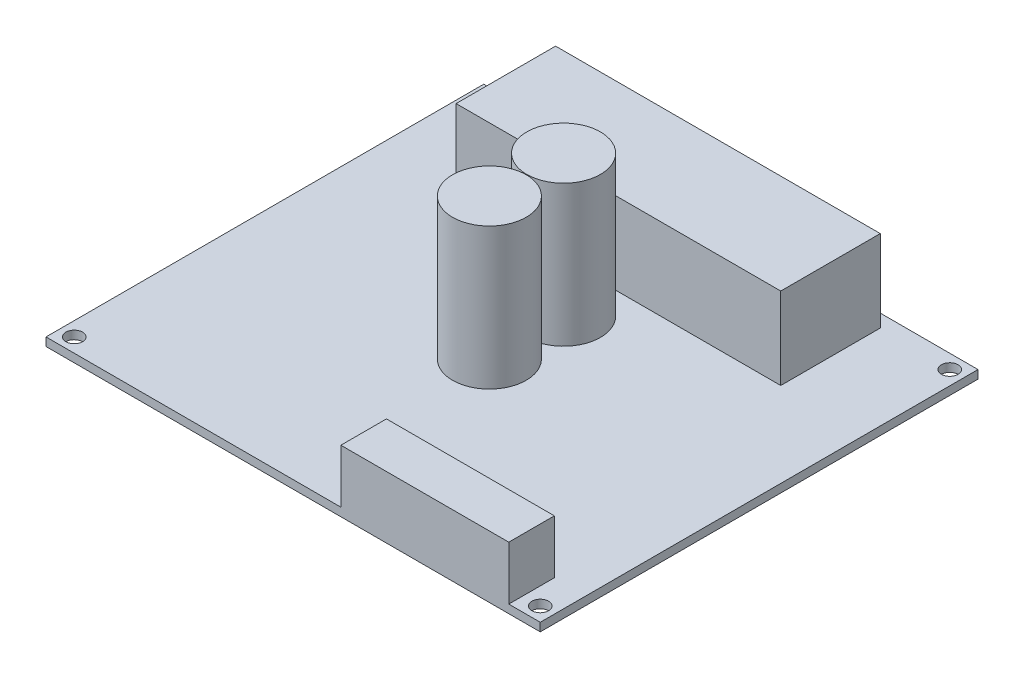
ISO-10303-21;
HEADER;
FILE_DESCRIPTION(('STEP AP214'),'2;1');
FILE_NAME('part.step','',(''),(''),'','','');
FILE_SCHEMA(('AUTOMOTIVE_DESIGN { 1 0 10303 214 1 1 1 1 }'));
ENDSEC;
DATA;
#1=APPLICATION_CONTEXT('core data for automotive mechanical design processes');
#2=APPLICATION_PROTOCOL_DEFINITION('international standard','automotive_design',2000,#1);
#3=PRODUCT_CONTEXT('',#1,'mechanical');
#4=PRODUCT('Part','Part','',(#3));
#5=PRODUCT_RELATED_PRODUCT_CATEGORY('part','',(#4));
#6=PRODUCT_DEFINITION_FORMATION('','',#4);
#7=PRODUCT_DEFINITION_CONTEXT('part definition',#1,'design');
#8=PRODUCT_DEFINITION('design','',#6,#7);
#9=PRODUCT_DEFINITION_SHAPE('','',#8);
#10=(LENGTH_UNIT() NAMED_UNIT(*) SI_UNIT(.MILLI.,.METRE.));
#11=(NAMED_UNIT(*) PLANE_ANGLE_UNIT() SI_UNIT($,.RADIAN.));
#12=(NAMED_UNIT(*) SI_UNIT($,.STERADIAN.) SOLID_ANGLE_UNIT());
#13=UNCERTAINTY_MEASURE_WITH_UNIT(LENGTH_MEASURE(1.E-05),#10,'distance_accuracy_value','');
#14=(GEOMETRIC_REPRESENTATION_CONTEXT(3) GLOBAL_UNCERTAINTY_ASSIGNED_CONTEXT((#13)) GLOBAL_UNIT_ASSIGNED_CONTEXT((#10,
#11,#12)) REPRESENTATION_CONTEXT('',''));
#15=CARTESIAN_POINT('',(0.,0.,0.));
#16=DIRECTION('',(0.,0.,1.));
#17=DIRECTION('',(1.,0.,0.));
#18=AXIS2_PLACEMENT_3D('',#15,#16,#17);
#19=CARTESIAN_POINT('',(0.,1.5,0.));
#20=DIRECTION('',(0.,1.,0.));
#21=DIRECTION('',(0.,0.,1.));
#22=AXIS2_PLACEMENT_3D('',#19,#20,#21);
#23=PLANE('',#22);
#24=CARTESIAN_POINT('',(-1.125,1.5,2.945));
#25=DIRECTION('',(0.,1.,0.));
#26=DIRECTION('',(0.,0.,1.));
#27=AXIS2_PLACEMENT_3D('',#24,#25,#26);
#28=CIRCLE('',#27,6.625);
#29=CARTESIAN_POINT('',(-1.125,1.5,9.57));
#30=VERTEX_POINT('',#29);
#31=EDGE_CURVE('E316',#30,#30,#28,.T.);
#32=ORIENTED_EDGE('',*,*,#31,.F.);
#33=EDGE_LOOP('',(#32));
#34=FACE_BOUND('',#33,.T.);
#35=CARTESIAN_POINT('',(-1.125,1.5,-10.405));
#36=DIRECTION('',(0.,1.,0.));
#37=DIRECTION('',(0.,0.,1.));
#38=AXIS2_PLACEMENT_3D('',#35,#36,#37);
#39=CIRCLE('',#38,6.62500000000001);
#40=CARTESIAN_POINT('',(-1.125,1.5,-3.78));
#41=VERTEX_POINT('',#40);
#42=EDGE_CURVE('E312',#41,#41,#39,.T.);
#43=ORIENTED_EDGE('',*,*,#42,.F.);
#44=EDGE_LOOP('',(#43));
#45=FACE_BOUND('',#44,.T.);
#46=CARTESIAN_POINT('',(41.91,1.5,-36.83));
#47=DIRECTION('',(0.,1.,0.));
#48=DIRECTION('',(0.,0.,1.));
#49=AXIS2_PLACEMENT_3D('',#46,#47,#48);
#50=CIRCLE('',#49,1.5);
#51=CARTESIAN_POINT('',(41.91,1.5,-35.33));
#52=VERTEX_POINT('',#51);
#53=EDGE_CURVE('E215',#52,#52,#50,.T.);
#54=ORIENTED_EDGE('',*,*,#53,.F.);
#55=EDGE_LOOP('',(#54));
#56=FACE_BOUND('',#55,.T.);
#57=CARTESIAN_POINT('',(-41.91,1.5,-36.83));
#58=DIRECTION('',(0.,1.,0.));
#59=DIRECTION('',(0.,0.,1.));
#60=AXIS2_PLACEMENT_3D('',#57,#58,#59);
#61=CIRCLE('',#60,1.5);
#62=CARTESIAN_POINT('',(-41.91,1.5,-35.33));
#63=VERTEX_POINT('',#62);
#64=EDGE_CURVE('E231',#63,#63,#61,.T.);
#65=ORIENTED_EDGE('',*,*,#64,.F.);
#66=EDGE_LOOP('',(#65));
#67=FACE_BOUND('',#66,.T.);
#68=CARTESIAN_POINT('',(41.91,1.5,36.83));
#69=DIRECTION('',(0.,1.,0.));
#70=DIRECTION('',(0.,0.,1.));
#71=AXIS2_PLACEMENT_3D('',#68,#69,#70);
#72=CIRCLE('',#71,1.5);
#73=CARTESIAN_POINT('',(41.91,1.5,38.33));
#74=VERTEX_POINT('',#73);
#75=EDGE_CURVE('E223',#74,#74,#72,.T.);
#76=ORIENTED_EDGE('',*,*,#75,.F.);
#77=EDGE_LOOP('',(#76));
#78=FACE_BOUND('',#77,.T.);
#79=CARTESIAN_POINT('',(-41.91,1.5,36.83));
#80=DIRECTION('',(0.,1.,0.));
#81=DIRECTION('',(0.,0.,1.));
#82=AXIS2_PLACEMENT_3D('',#79,#80,#81);
#83=CIRCLE('',#82,1.5);
#84=CARTESIAN_POINT('',(-41.91,1.5,38.33));
#85=VERTEX_POINT('',#84);
#86=EDGE_CURVE('E207',#85,#85,#83,.T.);
#87=ORIENTED_EDGE('',*,*,#86,.F.);
#88=EDGE_LOOP('',(#87));
#89=FACE_BOUND('',#88,.T.);
#90=DIRECTION('',(-1.,0.,0.));
#91=VECTOR('',#90,1.);
#92=CARTESIAN_POINT('',(-29.2,1.5,-37.04));
#93=LINE('',#92,#91);
#94=CARTESIAN_POINT('',(29.2,1.5,-37.04));
#95=VERTEX_POINT('',#94);
#96=CARTESIAN_POINT('',(-29.2,1.5,-37.04));
#97=VERTEX_POINT('',#96);
#98=EDGE_CURVE('E164',#95,#97,#93,.T.);
#99=ORIENTED_EDGE('',*,*,#98,.F.);
#100=DIRECTION('',(0.,0.,-1.));
#101=VECTOR('',#100,1.);
#102=CARTESIAN_POINT('',(29.2,1.5,-19.14));
#103=LINE('',#102,#101);
#104=CARTESIAN_POINT('',(29.2,1.5,-19.14));
#105=VERTEX_POINT('',#104);
#106=EDGE_CURVE('E159',#105,#95,#103,.T.);
#107=ORIENTED_EDGE('',*,*,#106,.F.);
#108=DIRECTION('',(1.,0.,0.));
#109=VECTOR('',#108,1.);
#110=CARTESIAN_POINT('',(-29.2,1.5,-19.14));
#111=LINE('',#110,#109);
#112=CARTESIAN_POINT('',(-29.2,1.5,-19.14));
#113=VERTEX_POINT('',#112);
#114=EDGE_CURVE('E175',#113,#105,#111,.T.);
#115=ORIENTED_EDGE('',*,*,#114,.F.);
#116=DIRECTION('',(0.,0.,1.));
#117=VECTOR('',#116,1.);
#118=CARTESIAN_POINT('',(-29.2,1.5,-19.14));
#119=LINE('',#118,#117);
#120=EDGE_CURVE('E187',#97,#113,#119,.T.);
#121=ORIENTED_EDGE('',*,*,#120,.F.);
#122=EDGE_LOOP('',(#99,#107,#115,#121));
#123=FACE_BOUND('',#122,.T.);
#124=DIRECTION('',(-1.,0.,0.));
#125=VECTOR('',#124,1.);
#126=CARTESIAN_POINT('',(8.59000000000001,1.5,31.17));
#127=LINE('',#126,#125);
#128=CARTESIAN_POINT('',(38.79,1.5,31.17));
#129=VERTEX_POINT('',#128);
#130=CARTESIAN_POINT('',(8.59000000000001,1.5,31.17));
#131=VERTEX_POINT('',#130);
#132=EDGE_CURVE('E61',#129,#131,#127,.T.);
#133=ORIENTED_EDGE('',*,*,#132,.F.);
#134=DIRECTION('',(0.,0.,-1.));
#135=VECTOR('',#134,1.);
#136=CARTESIAN_POINT('',(38.79,1.5,39.37));
#137=LINE('',#136,#135);
#138=CARTESIAN_POINT('',(38.79,1.5,39.37));
#139=VERTEX_POINT('',#138);
#140=EDGE_CURVE('E157',#139,#129,#137,.T.);
#141=ORIENTED_EDGE('',*,*,#140,.F.);
#142=DIRECTION('',(1.,0.,0.));
#143=VECTOR('',#142,1.);
#144=CARTESIAN_POINT('',(44.45,1.5,39.37));
#145=LINE('',#144,#143);
#146=CARTESIAN_POINT('',(44.45,1.5,39.37));
#147=VERTEX_POINT('',#146);
#148=EDGE_CURVE('E243',#139,#147,#145,.T.);
#149=ORIENTED_EDGE('',*,*,#148,.T.);
#150=DIRECTION('',(0.,0.,-1.));
#151=VECTOR('',#150,1.);
#152=CARTESIAN_POINT('',(44.45,1.5,39.37));
#153=LINE('',#152,#151);
#154=CARTESIAN_POINT('',(44.45,1.5,-39.37));
#155=VERTEX_POINT('',#154);
#156=EDGE_CURVE('E248',#147,#155,#153,.T.);
#157=ORIENTED_EDGE('',*,*,#156,.T.);
#158=DIRECTION('',(-1.,0.,0.));
#159=VECTOR('',#158,1.);
#160=CARTESIAN_POINT('',(44.45,1.5,-39.37));
#161=LINE('',#160,#159);
#162=CARTESIAN_POINT('',(-44.45,1.5,-39.37));
#163=VERTEX_POINT('',#162);
#164=EDGE_CURVE('E251',#155,#163,#161,.T.);
#165=ORIENTED_EDGE('',*,*,#164,.T.);
#166=DIRECTION('',(0.,0.,1.));
#167=VECTOR('',#166,1.);
#168=CARTESIAN_POINT('',(-44.45,1.5,39.37));
#169=LINE('',#168,#167);
#170=CARTESIAN_POINT('',(-44.45,1.5,39.37));
#171=VERTEX_POINT('',#170);
#172=EDGE_CURVE('E239',#163,#171,#169,.T.);
#173=ORIENTED_EDGE('',*,*,#172,.T.);
#174=CARTESIAN_POINT('',(8.59000000000001,1.5,39.37));
#175=VERTEX_POINT('',#174);
#176=EDGE_CURVE('E245',#171,#175,#145,.T.);
#177=ORIENTED_EDGE('',*,*,#176,.T.);
#178=DIRECTION('',(0.,0.,1.));
#179=VECTOR('',#178,1.);
#180=CARTESIAN_POINT('',(8.59000000000001,1.5,39.37));
#181=LINE('',#180,#179);
#182=EDGE_CURVE('E66',#131,#175,#181,.T.);
#183=ORIENTED_EDGE('',*,*,#182,.F.);
#184=EDGE_LOOP('',(#133,#141,#149,#157,#165,#173,#177,#183));
#185=FACE_BOUND('',#184,.T.);
#186=ADVANCED_FACE('F45',(#34,#45,#56,#67,#78,#89,#123,#185),#23,.T.);
#187=CARTESIAN_POINT('',(0.,0.,0.));
#188=DIRECTION('',(0.,1.,0.));
#189=DIRECTION('',(0.,0.,1.));
#190=AXIS2_PLACEMENT_3D('',#187,#188,#189);
#191=PLANE('',#190);
#192=DIRECTION('',(0.,0.,1.));
#193=VECTOR('',#192,1.);
#194=CARTESIAN_POINT('',(-44.45,0.,39.37));
#195=LINE('',#194,#193);
#196=CARTESIAN_POINT('',(-44.45,0.,-39.37));
#197=VERTEX_POINT('',#196);
#198=CARTESIAN_POINT('',(-44.45,0.,39.37));
#199=VERTEX_POINT('',#198);
#200=EDGE_CURVE('E235',#197,#199,#195,.T.);
#201=ORIENTED_EDGE('',*,*,#200,.F.);
#202=DIRECTION('',(-1.,0.,0.));
#203=VECTOR('',#202,1.);
#204=CARTESIAN_POINT('',(44.45,0.,-39.37));
#205=LINE('',#204,#203);
#206=CARTESIAN_POINT('',(44.45,0.,-39.37));
#207=VERTEX_POINT('',#206);
#208=EDGE_CURVE('E244',#207,#197,#205,.T.);
#209=ORIENTED_EDGE('',*,*,#208,.F.);
#210=DIRECTION('',(0.,0.,-1.));
#211=VECTOR('',#210,1.);
#212=CARTESIAN_POINT('',(44.45,0.,39.37));
#213=LINE('',#212,#211);
#214=CARTESIAN_POINT('',(44.45,0.,39.37));
#215=VERTEX_POINT('',#214);
#216=EDGE_CURVE('E261',#215,#207,#213,.T.);
#217=ORIENTED_EDGE('',*,*,#216,.F.);
#218=DIRECTION('',(1.,0.,0.));
#219=VECTOR('',#218,1.);
#220=CARTESIAN_POINT('',(44.45,0.,39.37));
#221=LINE('',#220,#219);
#222=EDGE_CURVE('E258',#199,#215,#221,.T.);
#223=ORIENTED_EDGE('',*,*,#222,.F.);
#224=EDGE_LOOP('',(#201,#209,#217,#223));
#225=FACE_BOUND('',#224,.T.);
#226=CARTESIAN_POINT('',(-41.91,0.,-36.83));
#227=DIRECTION('',(0.,1.,0.));
#228=DIRECTION('',(0.,0.,1.));
#229=AXIS2_PLACEMENT_3D('',#226,#227,#228);
#230=CIRCLE('',#229,1.5);
#231=CARTESIAN_POINT('',(-41.91,0.,-35.33));
#232=VERTEX_POINT('',#231);
#233=EDGE_CURVE('E227',#232,#232,#230,.T.);
#234=ORIENTED_EDGE('',*,*,#233,.T.);
#235=EDGE_LOOP('',(#234));
#236=FACE_BOUND('',#235,.T.);
#237=CARTESIAN_POINT('',(41.91,0.,36.83));
#238=DIRECTION('',(0.,1.,0.));
#239=DIRECTION('',(0.,0.,1.));
#240=AXIS2_PLACEMENT_3D('',#237,#238,#239);
#241=CIRCLE('',#240,1.5);
#242=CARTESIAN_POINT('',(41.91,0.,38.33));
#243=VERTEX_POINT('',#242);
#244=EDGE_CURVE('E219',#243,#243,#241,.T.);
#245=ORIENTED_EDGE('',*,*,#244,.T.);
#246=EDGE_LOOP('',(#245));
#247=FACE_BOUND('',#246,.T.);
#248=CARTESIAN_POINT('',(41.91,0.,-36.83));
#249=DIRECTION('',(0.,1.,0.));
#250=DIRECTION('',(0.,0.,1.));
#251=AXIS2_PLACEMENT_3D('',#248,#249,#250);
#252=CIRCLE('',#251,1.5);
#253=CARTESIAN_POINT('',(41.91,0.,-35.33));
#254=VERTEX_POINT('',#253);
#255=EDGE_CURVE('E211',#254,#254,#252,.T.);
#256=ORIENTED_EDGE('',*,*,#255,.T.);
#257=EDGE_LOOP('',(#256));
#258=FACE_BOUND('',#257,.T.);
#259=CARTESIAN_POINT('',(-41.91,0.,36.83));
#260=DIRECTION('',(0.,1.,0.));
#261=DIRECTION('',(0.,0.,1.));
#262=AXIS2_PLACEMENT_3D('',#259,#260,#261);
#263=CIRCLE('',#262,1.5);
#264=CARTESIAN_POINT('',(-41.91,0.,38.33));
#265=VERTEX_POINT('',#264);
#266=EDGE_CURVE('E206',#265,#265,#263,.T.);
#267=ORIENTED_EDGE('',*,*,#266,.T.);
#268=EDGE_LOOP('',(#267));
#269=FACE_BOUND('',#268,.T.);
#270=ADVANCED_FACE('F284',(#225,#236,#247,#258,#269),#191,.F.);
#271=CARTESIAN_POINT('',(-44.45,1.5,39.37));
#272=DIRECTION('',(1.,0.,0.));
#273=DIRECTION('',(0.,0.,-1.));
#274=AXIS2_PLACEMENT_3D('',#271,#272,#273);
#275=PLANE('',#274);
#276=ORIENTED_EDGE('',*,*,#200,.T.);
#277=DIRECTION('',(0.,-1.,0.));
#278=VECTOR('',#277,1.);
#279=CARTESIAN_POINT('',(-44.45,1.5,39.37));
#280=LINE('',#279,#278);
#281=EDGE_CURVE('E11',#171,#199,#280,.T.);
#282=ORIENTED_EDGE('',*,*,#281,.F.);
#283=ORIENTED_EDGE('',*,*,#172,.F.);
#284=DIRECTION('',(0.,-1.,0.));
#285=VECTOR('',#284,1.);
#286=CARTESIAN_POINT('',(-44.45,1.5,-39.37));
#287=LINE('',#286,#285);
#288=EDGE_CURVE('E254',#163,#197,#287,.T.);
#289=ORIENTED_EDGE('',*,*,#288,.T.);
#290=EDGE_LOOP('',(#276,#282,#283,#289));
#291=FACE_BOUND('',#290,.T.);
#292=ADVANCED_FACE('F47',(#291),#275,.F.);
#293=CARTESIAN_POINT('',(44.45,1.5,39.37));
#294=DIRECTION('',(0.,0.,-1.));
#295=DIRECTION('',(-1.,0.,0.));
#296=AXIS2_PLACEMENT_3D('',#293,#294,#295);
#297=PLANE('',#296);
#298=ORIENTED_EDGE('',*,*,#222,.T.);
#299=DIRECTION('',(0.,-1.,0.));
#300=VECTOR('',#299,1.);
#301=CARTESIAN_POINT('',(44.45,1.5,39.37));
#302=LINE('',#301,#300);
#303=EDGE_CURVE('E54',#147,#215,#302,.T.);
#304=ORIENTED_EDGE('',*,*,#303,.F.);
#305=ORIENTED_EDGE('',*,*,#148,.F.);
#306=DIRECTION('',(0.,-1.,0.));
#307=VECTOR('',#306,1.);
#308=CARTESIAN_POINT('',(38.79,11.15,39.37));
#309=LINE('',#308,#307);
#310=CARTESIAN_POINT('',(38.79,11.15,39.37));
#311=VERTEX_POINT('',#310);
#312=EDGE_CURVE('E295',#311,#139,#309,.T.);
#313=ORIENTED_EDGE('',*,*,#312,.F.);
#314=DIRECTION('',(1.,0.,0.));
#315=VECTOR('',#314,1.);
#316=CARTESIAN_POINT('',(8.59000000000001,11.15,39.37));
#317=LINE('',#316,#315);
#318=CARTESIAN_POINT('',(8.59000000000001,11.15,39.37));
#319=VERTEX_POINT('',#318);
#320=EDGE_CURVE('E150',#319,#311,#317,.T.);
#321=ORIENTED_EDGE('',*,*,#320,.F.);
#322=DIRECTION('',(0.,-1.,0.));
#323=VECTOR('',#322,1.);
#324=CARTESIAN_POINT('',(8.59000000000001,11.15,39.37));
#325=LINE('',#324,#323);
#326=EDGE_CURVE('E166',#319,#175,#325,.T.);
#327=ORIENTED_EDGE('',*,*,#326,.T.);
#328=ORIENTED_EDGE('',*,*,#176,.F.);
#329=ORIENTED_EDGE('',*,*,#281,.T.);
#330=EDGE_LOOP('',(#298,#304,#305,#313,#321,#327,#328,#329));
#331=FACE_BOUND('',#330,.T.);
#332=ADVANCED_FACE('F294',(#331),#297,.F.);
#333=CARTESIAN_POINT('',(44.45,1.5,39.37));
#334=DIRECTION('',(-1.,0.,0.));
#335=DIRECTION('',(0.,0.,1.));
#336=AXIS2_PLACEMENT_3D('',#333,#334,#335);
#337=PLANE('',#336);
#338=ORIENTED_EDGE('',*,*,#216,.T.);
#339=DIRECTION('',(0.,-1.,0.));
#340=VECTOR('',#339,1.);
#341=CARTESIAN_POINT('',(44.45,1.5,-39.37));
#342=LINE('',#341,#340);
#343=EDGE_CURVE('E269',#155,#207,#342,.T.);
#344=ORIENTED_EDGE('',*,*,#343,.F.);
#345=ORIENTED_EDGE('',*,*,#156,.F.);
#346=ORIENTED_EDGE('',*,*,#303,.T.);
#347=EDGE_LOOP('',(#338,#344,#345,#346));
#348=FACE_BOUND('',#347,.T.);
#349=ADVANCED_FACE('F278',(#348),#337,.F.);
#350=CARTESIAN_POINT('',(44.45,1.5,-39.37));
#351=DIRECTION('',(0.,0.,1.));
#352=DIRECTION('',(1.,0.,0.));
#353=AXIS2_PLACEMENT_3D('',#350,#351,#352);
#354=PLANE('',#353);
#355=ORIENTED_EDGE('',*,*,#208,.T.);
#356=ORIENTED_EDGE('',*,*,#288,.F.);
#357=ORIENTED_EDGE('',*,*,#164,.F.);
#358=ORIENTED_EDGE('',*,*,#343,.T.);
#359=EDGE_LOOP('',(#355,#356,#357,#358));
#360=FACE_BOUND('',#359,.T.);
#361=ADVANCED_FACE('F288',(#360),#354,.F.);
#362=CARTESIAN_POINT('',(-41.91,1.5,-36.83));
#363=DIRECTION('',(0.,-1.,0.));
#364=DIRECTION('',(0.,0.,-1.));
#365=AXIS2_PLACEMENT_3D('',#362,#363,#364);
#366=CYLINDRICAL_SURFACE('',#365,1.5);
#367=ORIENTED_EDGE('',*,*,#64,.T.);
#368=EDGE_LOOP('',(#367));
#369=FACE_BOUND('',#368,.T.);
#370=ORIENTED_EDGE('',*,*,#233,.F.);
#371=EDGE_LOOP('',(#370));
#372=FACE_BOUND('',#371,.T.);
#373=ADVANCED_FACE('F389',(#369,#372),#366,.F.);
#374=CARTESIAN_POINT('',(41.91,1.5,36.83));
#375=DIRECTION('',(0.,-1.,0.));
#376=DIRECTION('',(0.,0.,-1.));
#377=AXIS2_PLACEMENT_3D('',#374,#375,#376);
#378=CYLINDRICAL_SURFACE('',#377,1.5);
#379=ORIENTED_EDGE('',*,*,#75,.T.);
#380=EDGE_LOOP('',(#379));
#381=FACE_BOUND('',#380,.T.);
#382=ORIENTED_EDGE('',*,*,#244,.F.);
#383=EDGE_LOOP('',(#382));
#384=FACE_BOUND('',#383,.T.);
#385=ADVANCED_FACE('F385',(#381,#384),#378,.F.);
#386=CARTESIAN_POINT('',(41.91,1.5,-36.83));
#387=DIRECTION('',(0.,-1.,0.));
#388=DIRECTION('',(0.,0.,-1.));
#389=AXIS2_PLACEMENT_3D('',#386,#387,#388);
#390=CYLINDRICAL_SURFACE('',#389,1.5);
#391=ORIENTED_EDGE('',*,*,#53,.T.);
#392=EDGE_LOOP('',(#391));
#393=FACE_BOUND('',#392,.T.);
#394=ORIENTED_EDGE('',*,*,#255,.F.);
#395=EDGE_LOOP('',(#394));
#396=FACE_BOUND('',#395,.T.);
#397=ADVANCED_FACE('F381',(#393,#396),#390,.F.);
#398=CARTESIAN_POINT('',(-41.91,1.5,36.83));
#399=DIRECTION('',(0.,-1.,0.));
#400=DIRECTION('',(0.,0.,-1.));
#401=AXIS2_PLACEMENT_3D('',#398,#399,#400);
#402=CYLINDRICAL_SURFACE('',#401,1.5);
#403=ORIENTED_EDGE('',*,*,#86,.T.);
#404=EDGE_LOOP('',(#403));
#405=FACE_BOUND('',#404,.T.);
#406=ORIENTED_EDGE('',*,*,#266,.F.);
#407=EDGE_LOOP('',(#406));
#408=FACE_BOUND('',#407,.T.);
#409=ADVANCED_FACE('F378',(#405,#408),#402,.F.);
#410=CARTESIAN_POINT('',(29.2,16.22,-19.14));
#411=DIRECTION('',(-1.,0.,0.));
#412=DIRECTION('',(0.,0.,1.));
#413=AXIS2_PLACEMENT_3D('',#410,#411,#412);
#414=PLANE('',#413);
#415=ORIENTED_EDGE('',*,*,#106,.T.);
#416=DIRECTION('',(0.,-1.,0.));
#417=VECTOR('',#416,1.);
#418=CARTESIAN_POINT('',(29.2,16.22,-37.04));
#419=LINE('',#418,#417);
#420=CARTESIAN_POINT('',(29.2,16.22,-37.04));
#421=VERTEX_POINT('',#420);
#422=EDGE_CURVE('E203',#421,#95,#419,.T.);
#423=ORIENTED_EDGE('',*,*,#422,.F.);
#424=DIRECTION('',(0.,0.,-1.));
#425=VECTOR('',#424,1.);
#426=CARTESIAN_POINT('',(29.2,16.22,-19.14));
#427=LINE('',#426,#425);
#428=CARTESIAN_POINT('',(29.2,16.22,-19.14));
#429=VERTEX_POINT('',#428);
#430=EDGE_CURVE('E170',#429,#421,#427,.T.);
#431=ORIENTED_EDGE('',*,*,#430,.F.);
#432=DIRECTION('',(0.,-1.,0.));
#433=VECTOR('',#432,1.);
#434=CARTESIAN_POINT('',(29.2,16.22,-19.14));
#435=LINE('',#434,#433);
#436=EDGE_CURVE('E183',#429,#105,#435,.T.);
#437=ORIENTED_EDGE('',*,*,#436,.T.);
#438=EDGE_LOOP('',(#415,#423,#431,#437));
#439=FACE_BOUND('',#438,.T.);
#440=ADVANCED_FACE('F361',(#439),#414,.F.);
#441=CARTESIAN_POINT('',(-29.2,16.22,-37.04));
#442=DIRECTION('',(0.,0.,1.));
#443=DIRECTION('',(1.,0.,0.));
#444=AXIS2_PLACEMENT_3D('',#441,#442,#443);
#445=PLANE('',#444);
#446=ORIENTED_EDGE('',*,*,#98,.T.);
#447=DIRECTION('',(0.,-1.,0.));
#448=VECTOR('',#447,1.);
#449=CARTESIAN_POINT('',(-29.2,16.22,-37.04));
#450=LINE('',#449,#448);
#451=CARTESIAN_POINT('',(-29.2,16.22,-37.04));
#452=VERTEX_POINT('',#451);
#453=EDGE_CURVE('E199',#452,#97,#450,.T.);
#454=ORIENTED_EDGE('',*,*,#453,.F.);
#455=DIRECTION('',(-1.,0.,0.));
#456=VECTOR('',#455,1.);
#457=CARTESIAN_POINT('',(-29.2,16.22,-37.04));
#458=LINE('',#457,#456);
#459=EDGE_CURVE('E174',#421,#452,#458,.T.);
#460=ORIENTED_EDGE('',*,*,#459,.F.);
#461=ORIENTED_EDGE('',*,*,#422,.T.);
#462=EDGE_LOOP('',(#446,#454,#460,#461));
#463=FACE_BOUND('',#462,.T.);
#464=ADVANCED_FACE('F349',(#463),#445,.F.);
#465=CARTESIAN_POINT('',(-29.2,16.22,-19.14));
#466=DIRECTION('',(1.,0.,0.));
#467=DIRECTION('',(0.,0.,-1.));
#468=AXIS2_PLACEMENT_3D('',#465,#466,#467);
#469=PLANE('',#468);
#470=ORIENTED_EDGE('',*,*,#120,.T.);
#471=DIRECTION('',(0.,-1.,0.));
#472=VECTOR('',#471,1.);
#473=CARTESIAN_POINT('',(-29.2,16.22,-19.14));
#474=LINE('',#473,#472);
#475=CARTESIAN_POINT('',(-29.2,16.22,-19.14));
#476=VERTEX_POINT('',#475);
#477=EDGE_CURVE('E196',#476,#113,#474,.T.);
#478=ORIENTED_EDGE('',*,*,#477,.F.);
#479=DIRECTION('',(0.,0.,1.));
#480=VECTOR('',#479,1.);
#481=CARTESIAN_POINT('',(-29.2,16.22,-19.14));
#482=LINE('',#481,#480);
#483=EDGE_CURVE('E178',#452,#476,#482,.T.);
#484=ORIENTED_EDGE('',*,*,#483,.F.);
#485=ORIENTED_EDGE('',*,*,#453,.T.);
#486=EDGE_LOOP('',(#470,#478,#484,#485));
#487=FACE_BOUND('',#486,.T.);
#488=ADVANCED_FACE('F353',(#487),#469,.F.);
#489=CARTESIAN_POINT('',(-29.2,16.22,-19.14));
#490=DIRECTION('',(0.,0.,-1.));
#491=DIRECTION('',(-1.,0.,0.));
#492=AXIS2_PLACEMENT_3D('',#489,#490,#491);
#493=PLANE('',#492);
#494=ORIENTED_EDGE('',*,*,#114,.T.);
#495=ORIENTED_EDGE('',*,*,#436,.F.);
#496=DIRECTION('',(1.,0.,0.));
#497=VECTOR('',#496,1.);
#498=CARTESIAN_POINT('',(-29.2,16.22,-19.14));
#499=LINE('',#498,#497);
#500=EDGE_CURVE('E181',#476,#429,#499,.T.);
#501=ORIENTED_EDGE('',*,*,#500,.F.);
#502=ORIENTED_EDGE('',*,*,#477,.T.);
#503=EDGE_LOOP('',(#494,#495,#501,#502));
#504=FACE_BOUND('',#503,.T.);
#505=ADVANCED_FACE('F363',(#504),#493,.F.);
#506=CARTESIAN_POINT('',(0.,16.22,0.));
#507=DIRECTION('',(0.,-1.,0.));
#508=DIRECTION('',(0.,0.,-1.));
#509=AXIS2_PLACEMENT_3D('',#506,#507,#508);
#510=PLANE('',#509);
#511=ORIENTED_EDGE('',*,*,#430,.T.);
#512=ORIENTED_EDGE('',*,*,#459,.T.);
#513=ORIENTED_EDGE('',*,*,#483,.T.);
#514=ORIENTED_EDGE('',*,*,#500,.T.);
#515=EDGE_LOOP('',(#511,#512,#513,#514));
#516=FACE_BOUND('',#515,.T.);
#517=ADVANCED_FACE('F357',(#516),#510,.F.);
#518=CARTESIAN_POINT('',(38.79,11.15,39.37));
#519=DIRECTION('',(-1.,0.,0.));
#520=DIRECTION('',(0.,0.,1.));
#521=AXIS2_PLACEMENT_3D('',#518,#519,#520);
#522=PLANE('',#521);
#523=ORIENTED_EDGE('',*,*,#140,.T.);
#524=DIRECTION('',(0.,-1.,0.));
#525=VECTOR('',#524,1.);
#526=CARTESIAN_POINT('',(38.79,11.15,31.17));
#527=LINE('',#526,#525);
#528=CARTESIAN_POINT('',(38.79,11.15,31.17));
#529=VERTEX_POINT('',#528);
#530=EDGE_CURVE('E137',#529,#129,#527,.T.);
#531=ORIENTED_EDGE('',*,*,#530,.F.);
#532=DIRECTION('',(0.,0.,-1.));
#533=VECTOR('',#532,1.);
#534=CARTESIAN_POINT('',(38.79,11.15,39.37));
#535=LINE('',#534,#533);
#536=EDGE_CURVE('E145',#311,#529,#535,.T.);
#537=ORIENTED_EDGE('',*,*,#536,.F.);
#538=ORIENTED_EDGE('',*,*,#312,.T.);
#539=EDGE_LOOP('',(#523,#531,#537,#538));
#540=FACE_BOUND('',#539,.T.);
#541=ADVANCED_FACE('F156',(#540),#522,.F.);
#542=CARTESIAN_POINT('',(8.59000000000001,11.15,31.17));
#543=DIRECTION('',(0.,0.,1.));
#544=DIRECTION('',(1.,0.,0.));
#545=AXIS2_PLACEMENT_3D('',#542,#543,#544);
#546=PLANE('',#545);
#547=ORIENTED_EDGE('',*,*,#132,.T.);
#548=DIRECTION('',(0.,-1.,0.));
#549=VECTOR('',#548,1.);
#550=CARTESIAN_POINT('',(8.59000000000001,11.15,31.17));
#551=LINE('',#550,#549);
#552=CARTESIAN_POINT('',(8.59000000000001,11.15,31.17));
#553=VERTEX_POINT('',#552);
#554=EDGE_CURVE('E140',#553,#131,#551,.T.);
#555=ORIENTED_EDGE('',*,*,#554,.F.);
#556=DIRECTION('',(-1.,0.,0.));
#557=VECTOR('',#556,1.);
#558=CARTESIAN_POINT('',(8.59000000000001,11.15,31.17));
#559=LINE('',#558,#557);
#560=EDGE_CURVE('E133',#529,#553,#559,.T.);
#561=ORIENTED_EDGE('',*,*,#560,.F.);
#562=ORIENTED_EDGE('',*,*,#530,.T.);
#563=EDGE_LOOP('',(#547,#555,#561,#562));
#564=FACE_BOUND('',#563,.T.);
#565=ADVANCED_FACE('F135',(#564),#546,.F.);
#566=CARTESIAN_POINT('',(8.59000000000001,11.15,39.37));
#567=DIRECTION('',(1.,0.,0.));
#568=DIRECTION('',(0.,0.,-1.));
#569=AXIS2_PLACEMENT_3D('',#566,#567,#568);
#570=PLANE('',#569);
#571=ORIENTED_EDGE('',*,*,#182,.T.);
#572=ORIENTED_EDGE('',*,*,#326,.F.);
#573=DIRECTION('',(0.,0.,1.));
#574=VECTOR('',#573,1.);
#575=CARTESIAN_POINT('',(8.59000000000001,11.15,39.37));
#576=LINE('',#575,#574);
#577=EDGE_CURVE('E144',#553,#319,#576,.T.);
#578=ORIENTED_EDGE('',*,*,#577,.F.);
#579=ORIENTED_EDGE('',*,*,#554,.T.);
#580=EDGE_LOOP('',(#571,#572,#578,#579));
#581=FACE_BOUND('',#580,.T.);
#582=ADVANCED_FACE('F493',(#581),#570,.F.);
#583=CARTESIAN_POINT('',(0.,11.15,0.));
#584=DIRECTION('',(0.,-1.,0.));
#585=DIRECTION('',(0.,0.,-1.));
#586=AXIS2_PLACEMENT_3D('',#583,#584,#585);
#587=PLANE('',#586);
#588=ORIENTED_EDGE('',*,*,#536,.T.);
#589=ORIENTED_EDGE('',*,*,#560,.T.);
#590=ORIENTED_EDGE('',*,*,#577,.T.);
#591=ORIENTED_EDGE('',*,*,#320,.T.);
#592=EDGE_LOOP('',(#588,#589,#590,#591));
#593=FACE_BOUND('',#592,.T.);
#594=ADVANCED_FACE('F148',(#593),#587,.F.);
#595=CARTESIAN_POINT('',(-1.125,26.9,-10.405));
#596=DIRECTION('',(0.,-1.,0.));
#597=DIRECTION('',(0.,0.,-1.));
#598=AXIS2_PLACEMENT_3D('',#595,#596,#597);
#599=CYLINDRICAL_SURFACE('',#598,6.62500000000001);
#600=CARTESIAN_POINT('',(-1.125,26.9,-10.405));
#601=DIRECTION('',(0.,1.,0.));
#602=DIRECTION('',(0.,0.,1.));
#603=AXIS2_PLACEMENT_3D('',#600,#601,#602);
#604=CIRCLE('',#603,6.62500000000001);
#605=CARTESIAN_POINT('',(-1.125,26.9,-3.78));
#606=VERTEX_POINT('',#605);
#607=EDGE_CURVE('E308',#606,#606,#604,.T.);
#608=ORIENTED_EDGE('',*,*,#607,.F.);
#609=EDGE_LOOP('',(#608));
#610=FACE_BOUND('',#609,.T.);
#611=ORIENTED_EDGE('',*,*,#42,.T.);
#612=EDGE_LOOP('',(#611));
#613=FACE_BOUND('',#612,.T.);
#614=ADVANCED_FACE('F510',(#610,#613),#599,.T.);
#615=CARTESIAN_POINT('',(-1.125,26.9,-10.405));
#616=DIRECTION('',(0.,1.,0.));
#617=DIRECTION('',(0.,0.,1.));
#618=AXIS2_PLACEMENT_3D('',#615,#616,#617);
#619=PLANE('',#618);
#620=ORIENTED_EDGE('',*,*,#607,.T.);
#621=EDGE_LOOP('',(#620));
#622=FACE_BOUND('',#621,.T.);
#623=ADVANCED_FACE('F518',(#622),#619,.T.);
#624=CARTESIAN_POINT('',(-1.125,26.9,2.945));
#625=DIRECTION('',(0.,-1.,0.));
#626=DIRECTION('',(0.,0.,-1.));
#627=AXIS2_PLACEMENT_3D('',#624,#625,#626);
#628=CYLINDRICAL_SURFACE('',#627,6.625);
#629=CARTESIAN_POINT('',(-1.125,26.9,2.945));
#630=DIRECTION('',(0.,1.,0.));
#631=DIRECTION('',(0.,0.,1.));
#632=AXIS2_PLACEMENT_3D('',#629,#630,#631);
#633=CIRCLE('',#632,6.625);
#634=CARTESIAN_POINT('',(-1.125,26.9,9.57));
#635=VERTEX_POINT('',#634);
#636=EDGE_CURVE('E320',#635,#635,#633,.T.);
#637=ORIENTED_EDGE('',*,*,#636,.F.);
#638=EDGE_LOOP('',(#637));
#639=FACE_BOUND('',#638,.T.);
#640=ORIENTED_EDGE('',*,*,#31,.T.);
#641=EDGE_LOOP('',(#640));
#642=FACE_BOUND('',#641,.T.);
#643=ADVANCED_FACE('F328',(#639,#642),#628,.T.);
#644=CARTESIAN_POINT('',(-1.125,26.9,2.945));
#645=DIRECTION('',(0.,1.,0.));
#646=DIRECTION('',(0.,0.,1.));
#647=AXIS2_PLACEMENT_3D('',#644,#645,#646);
#648=PLANE('',#647);
#649=ORIENTED_EDGE('',*,*,#636,.T.);
#650=EDGE_LOOP('',(#649));
#651=FACE_BOUND('',#650,.T.);
#652=ADVANCED_FACE('F537',(#651),#648,.T.);
#653=CLOSED_SHELL('',(#186,#270,#292,#332,#349,#361,#373,#385,#397,#409,#440,#464,#488,#505,
#517,#541,#565,#582,#594,#614,#623,#643,#652));
#654=MANIFOLD_SOLID_BREP('B2',#653);
#655=ADVANCED_BREP_SHAPE_REPRESENTATION('',(#18,#654),#14);
#656=SHAPE_DEFINITION_REPRESENTATION(#9,#655);
ENDSEC;
END-ISO-10303-21;
